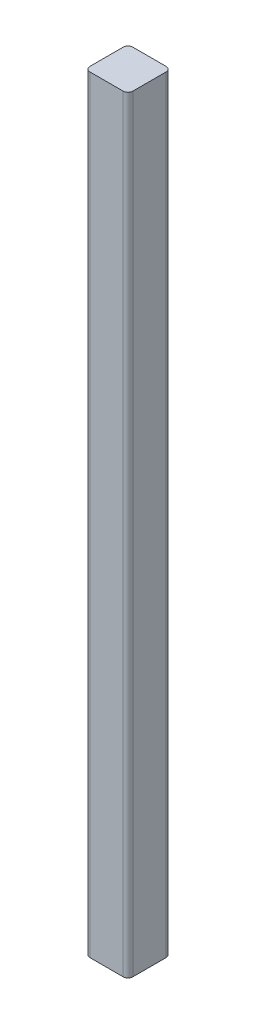
ISO-10303-21;
HEADER;
FILE_DESCRIPTION(('STEP AP214'),'2;1');
FILE_NAME('part.step','',(''),(''),'','','');
FILE_SCHEMA(('AUTOMOTIVE_DESIGN { 1 0 10303 214 1 1 1 1 }'));
ENDSEC;
DATA;
#1=APPLICATION_CONTEXT('core data for automotive mechanical design processes');
#2=APPLICATION_PROTOCOL_DEFINITION('international standard','automotive_design',2000,#1);
#3=PRODUCT_CONTEXT('',#1,'mechanical');
#4=PRODUCT('Part','Part','',(#3));
#5=PRODUCT_RELATED_PRODUCT_CATEGORY('part','',(#4));
#6=PRODUCT_DEFINITION_FORMATION('','',#4);
#7=PRODUCT_DEFINITION_CONTEXT('part definition',#1,'design');
#8=PRODUCT_DEFINITION('design','',#6,#7);
#9=PRODUCT_DEFINITION_SHAPE('','',#8);
#10=(LENGTH_UNIT() NAMED_UNIT(*) SI_UNIT(.MILLI.,.METRE.));
#11=(NAMED_UNIT(*) PLANE_ANGLE_UNIT() SI_UNIT($,.RADIAN.));
#12=(NAMED_UNIT(*) SI_UNIT($,.STERADIAN.) SOLID_ANGLE_UNIT());
#13=UNCERTAINTY_MEASURE_WITH_UNIT(LENGTH_MEASURE(1.E-05),#10,'distance_accuracy_value','');
#14=(GEOMETRIC_REPRESENTATION_CONTEXT(3) GLOBAL_UNCERTAINTY_ASSIGNED_CONTEXT((#13)) GLOBAL_UNIT_ASSIGNED_CONTEXT((#10,
#11,#12)) REPRESENTATION_CONTEXT('',''));
#15=CARTESIAN_POINT('',(0.,0.,0.));
#16=DIRECTION('',(0.,0.,1.));
#17=DIRECTION('',(1.,0.,0.));
#18=AXIS2_PLACEMENT_3D('',#15,#16,#17);
#19=CARTESIAN_POINT('',(20.,715.,-20.));
#20=DIRECTION('',(-1.,0.,0.));
#21=DIRECTION('',(0.,0.,1.));
#22=AXIS2_PLACEMENT_3D('',#19,#20,#21);
#23=PLANE('',#22);
#24=DIRECTION('',(0.,0.,-1.));
#25=VECTOR('',#24,1.);
#26=CARTESIAN_POINT('',(20.,0.,-20.));
#27=LINE('',#26,#25);
#28=CARTESIAN_POINT('',(20.,0.,15.5));
#29=VERTEX_POINT('',#28);
#30=CARTESIAN_POINT('',(20.,0.,-15.5));
#31=VERTEX_POINT('',#30);
#32=EDGE_CURVE('E141',#29,#31,#27,.T.);
#33=ORIENTED_EDGE('',*,*,#32,.T.);
#34=DIRECTION('',(0.,-1.,0.));
#35=VECTOR('',#34,1.);
#36=CARTESIAN_POINT('',(20.,715.,-15.5));
#37=LINE('',#36,#35);
#38=CARTESIAN_POINT('',(20.,715.,-15.5));
#39=VERTEX_POINT('',#38);
#40=EDGE_CURVE('E11',#31,#39,#37,.F.);
#41=ORIENTED_EDGE('',*,*,#40,.T.);
#42=DIRECTION('',(0.,0.,-1.));
#43=VECTOR('',#42,1.);
#44=CARTESIAN_POINT('',(20.,715.,-20.));
#45=LINE('',#44,#43);
#46=CARTESIAN_POINT('',(20.,715.,15.5));
#47=VERTEX_POINT('',#46);
#48=EDGE_CURVE('E139',#47,#39,#45,.T.);
#49=ORIENTED_EDGE('',*,*,#48,.F.);
#50=DIRECTION('',(0.,-1.,0.));
#51=VECTOR('',#50,1.);
#52=CARTESIAN_POINT('',(20.,715.,15.5));
#53=LINE('',#52,#51);
#54=EDGE_CURVE('E48',#47,#29,#53,.T.);
#55=ORIENTED_EDGE('',*,*,#54,.T.);
#56=EDGE_LOOP('',(#33,#41,#49,#55));
#57=FACE_BOUND('',#56,.T.);
#58=ADVANCED_FACE('F39',(#57),#23,.F.);
#59=CARTESIAN_POINT('',(-20.,715.,-20.));
#60=DIRECTION('',(0.,0.,1.));
#61=DIRECTION('',(1.,0.,0.));
#62=AXIS2_PLACEMENT_3D('',#59,#60,#61);
#63=PLANE('',#62);
#64=DIRECTION('',(-1.,0.,0.));
#65=VECTOR('',#64,1.);
#66=CARTESIAN_POINT('',(-20.,0.,-20.));
#67=LINE('',#66,#65);
#68=CARTESIAN_POINT('',(15.5,0.,-20.));
#69=VERTEX_POINT('',#68);
#70=CARTESIAN_POINT('',(-15.5,0.,-20.));
#71=VERTEX_POINT('',#70);
#72=EDGE_CURVE('E135',#69,#71,#67,.T.);
#73=ORIENTED_EDGE('',*,*,#72,.T.);
#74=DIRECTION('',(0.,-1.,0.));
#75=VECTOR('',#74,1.);
#76=CARTESIAN_POINT('',(-15.5,715.,-20.));
#77=LINE('',#76,#75);
#78=CARTESIAN_POINT('',(-15.5,715.,-20.));
#79=VERTEX_POINT('',#78);
#80=EDGE_CURVE('E111',#71,#79,#77,.F.);
#81=ORIENTED_EDGE('',*,*,#80,.T.);
#82=DIRECTION('',(-1.,0.,0.));
#83=VECTOR('',#82,1.);
#84=CARTESIAN_POINT('',(-20.,715.,-20.));
#85=LINE('',#84,#83);
#86=CARTESIAN_POINT('',(15.5,715.,-20.));
#87=VERTEX_POINT('',#86);
#88=EDGE_CURVE('E193',#87,#79,#85,.T.);
#89=ORIENTED_EDGE('',*,*,#88,.F.);
#90=DIRECTION('',(0.,-1.,0.));
#91=VECTOR('',#90,1.);
#92=CARTESIAN_POINT('',(15.5,715.,-20.));
#93=LINE('',#92,#91);
#94=EDGE_CURVE('E117',#87,#69,#93,.T.);
#95=ORIENTED_EDGE('',*,*,#94,.T.);
#96=EDGE_LOOP('',(#73,#81,#89,#95));
#97=FACE_BOUND('',#96,.T.);
#98=ADVANCED_FACE('F205',(#97),#63,.F.);
#99=CARTESIAN_POINT('',(-20.,715.,-20.));
#100=DIRECTION('',(1.,0.,0.));
#101=DIRECTION('',(0.,0.,-1.));
#102=AXIS2_PLACEMENT_3D('',#99,#100,#101);
#103=PLANE('',#102);
#104=DIRECTION('',(0.,0.,1.));
#105=VECTOR('',#104,1.);
#106=CARTESIAN_POINT('',(-20.,715.,-20.));
#107=LINE('',#106,#105);
#108=CARTESIAN_POINT('',(-20.,715.,-15.5));
#109=VERTEX_POINT('',#108);
#110=CARTESIAN_POINT('',(-20.,715.,15.5));
#111=VERTEX_POINT('',#110);
#112=EDGE_CURVE('E126',#109,#111,#107,.T.);
#113=ORIENTED_EDGE('',*,*,#112,.F.);
#114=DIRECTION('',(0.,-1.,0.));
#115=VECTOR('',#114,1.);
#116=CARTESIAN_POINT('',(-20.,715.,-15.5));
#117=LINE('',#116,#115);
#118=CARTESIAN_POINT('',(-20.,0.,-15.5));
#119=VERTEX_POINT('',#118);
#120=EDGE_CURVE('E110',#109,#119,#117,.T.);
#121=ORIENTED_EDGE('',*,*,#120,.T.);
#122=DIRECTION('',(0.,0.,1.));
#123=VECTOR('',#122,1.);
#124=CARTESIAN_POINT('',(-20.,0.,-20.));
#125=LINE('',#124,#123);
#126=CARTESIAN_POINT('',(-20.,0.,15.5));
#127=VERTEX_POINT('',#126);
#128=EDGE_CURVE('E124',#119,#127,#125,.T.);
#129=ORIENTED_EDGE('',*,*,#128,.T.);
#130=DIRECTION('',(0.,-1.,0.));
#131=VECTOR('',#130,1.);
#132=CARTESIAN_POINT('',(-20.,715.,15.5));
#133=LINE('',#132,#131);
#134=EDGE_CURVE('E129',#127,#111,#133,.F.);
#135=ORIENTED_EDGE('',*,*,#134,.T.);
#136=EDGE_LOOP('',(#113,#121,#129,#135));
#137=FACE_BOUND('',#136,.T.);
#138=ADVANCED_FACE('F123',(#137),#103,.F.);
#139=CARTESIAN_POINT('',(-20.,715.,20.));
#140=DIRECTION('',(0.,0.,-1.));
#141=DIRECTION('',(-1.,0.,0.));
#142=AXIS2_PLACEMENT_3D('',#139,#140,#141);
#143=PLANE('',#142);
#144=DIRECTION('',(1.,0.,0.));
#145=VECTOR('',#144,1.);
#146=CARTESIAN_POINT('',(-20.,715.,20.));
#147=LINE('',#146,#145);
#148=CARTESIAN_POINT('',(-15.5,715.,20.));
#149=VERTEX_POINT('',#148);
#150=CARTESIAN_POINT('',(15.5,715.,20.));
#151=VERTEX_POINT('',#150);
#152=EDGE_CURVE('E146',#149,#151,#147,.T.);
#153=ORIENTED_EDGE('',*,*,#152,.F.);
#154=DIRECTION('',(0.,-1.,0.));
#155=VECTOR('',#154,1.);
#156=CARTESIAN_POINT('',(-15.5,715.,20.));
#157=LINE('',#156,#155);
#158=CARTESIAN_POINT('',(-15.5,0.,20.));
#159=VERTEX_POINT('',#158);
#160=EDGE_CURVE('E173',#149,#159,#157,.T.);
#161=ORIENTED_EDGE('',*,*,#160,.T.);
#162=DIRECTION('',(1.,0.,0.));
#163=VECTOR('',#162,1.);
#164=CARTESIAN_POINT('',(-20.,0.,20.));
#165=LINE('',#164,#163);
#166=CARTESIAN_POINT('',(15.5,0.,20.));
#167=VERTEX_POINT('',#166);
#168=EDGE_CURVE('E134',#159,#167,#165,.T.);
#169=ORIENTED_EDGE('',*,*,#168,.T.);
#170=DIRECTION('',(0.,-1.,0.));
#171=VECTOR('',#170,1.);
#172=CARTESIAN_POINT('',(15.5,715.,20.));
#173=LINE('',#172,#171);
#174=EDGE_CURVE('E55',#167,#151,#173,.F.);
#175=ORIENTED_EDGE('',*,*,#174,.T.);
#176=EDGE_LOOP('',(#153,#161,#169,#175));
#177=FACE_BOUND('',#176,.T.);
#178=ADVANCED_FACE('F209',(#177),#143,.F.);
#179=CARTESIAN_POINT('',(0.,715.,0.));
#180=DIRECTION('',(0.,1.,0.));
#181=DIRECTION('',(0.,0.,1.));
#182=AXIS2_PLACEMENT_3D('',#179,#180,#181);
#183=PLANE('',#182);
#184=ORIENTED_EDGE('',*,*,#88,.T.);
#185=CARTESIAN_POINT('',(-15.5,715.,-15.5));
#186=DIRECTION('',(0.,1.,0.));
#187=DIRECTION('',(0.,0.,1.));
#188=AXIS2_PLACEMENT_3D('',#185,#186,#187);
#189=CIRCLE('',#188,4.5);
#190=EDGE_CURVE('E168',#79,#109,#189,.T.);
#191=ORIENTED_EDGE('',*,*,#190,.T.);
#192=ORIENTED_EDGE('',*,*,#112,.T.);
#193=CARTESIAN_POINT('',(-15.5,715.,15.5));
#194=DIRECTION('',(0.,1.,0.));
#195=DIRECTION('',(0.,0.,1.));
#196=AXIS2_PLACEMENT_3D('',#193,#194,#195);
#197=CIRCLE('',#196,4.5);
#198=EDGE_CURVE('E62',#111,#149,#197,.T.);
#199=ORIENTED_EDGE('',*,*,#198,.T.);
#200=ORIENTED_EDGE('',*,*,#152,.T.);
#201=CARTESIAN_POINT('',(15.5,715.,15.5));
#202=DIRECTION('',(0.,1.,0.));
#203=DIRECTION('',(0.,0.,1.));
#204=AXIS2_PLACEMENT_3D('',#201,#202,#203);
#205=CIRCLE('',#204,4.5);
#206=EDGE_CURVE('E160',#151,#47,#205,.T.);
#207=ORIENTED_EDGE('',*,*,#206,.T.);
#208=ORIENTED_EDGE('',*,*,#48,.T.);
#209=CARTESIAN_POINT('',(15.5,715.,-15.5));
#210=DIRECTION('',(0.,1.,0.));
#211=DIRECTION('',(0.,0.,1.));
#212=AXIS2_PLACEMENT_3D('',#209,#210,#211);
#213=CIRCLE('',#212,4.5);
#214=EDGE_CURVE('E163',#39,#87,#213,.T.);
#215=ORIENTED_EDGE('',*,*,#214,.T.);
#216=EDGE_LOOP('',(#184,#191,#192,#199,#200,#207,#208,#215));
#217=FACE_BOUND('',#216,.T.);
#218=ADVANCED_FACE('F199',(#217),#183,.T.);
#219=CARTESIAN_POINT('',(0.,0.,0.));
#220=DIRECTION('',(0.,1.,0.));
#221=DIRECTION('',(0.,0.,1.));
#222=AXIS2_PLACEMENT_3D('',#219,#220,#221);
#223=PLANE('',#222);
#224=ORIENTED_EDGE('',*,*,#128,.F.);
#225=CARTESIAN_POINT('',(-15.5,0.,-15.5));
#226=DIRECTION('',(0.,1.,0.));
#227=DIRECTION('',(0.,0.,1.));
#228=AXIS2_PLACEMENT_3D('',#225,#226,#227);
#229=CIRCLE('',#228,4.5);
#230=EDGE_CURVE('E106',#119,#71,#229,.F.);
#231=ORIENTED_EDGE('',*,*,#230,.T.);
#232=ORIENTED_EDGE('',*,*,#72,.F.);
#233=CARTESIAN_POINT('',(15.5,0.,-15.5));
#234=DIRECTION('',(0.,1.,0.));
#235=DIRECTION('',(0.,0.,1.));
#236=AXIS2_PLACEMENT_3D('',#233,#234,#235);
#237=CIRCLE('',#236,4.5);
#238=EDGE_CURVE('E150',#69,#31,#237,.F.);
#239=ORIENTED_EDGE('',*,*,#238,.T.);
#240=ORIENTED_EDGE('',*,*,#32,.F.);
#241=CARTESIAN_POINT('',(15.5,0.,15.5));
#242=DIRECTION('',(0.,1.,0.));
#243=DIRECTION('',(0.,0.,1.));
#244=AXIS2_PLACEMENT_3D('',#241,#242,#243);
#245=CIRCLE('',#244,4.5);
#246=EDGE_CURVE('E128',#29,#167,#245,.F.);
#247=ORIENTED_EDGE('',*,*,#246,.T.);
#248=ORIENTED_EDGE('',*,*,#168,.F.);
#249=CARTESIAN_POINT('',(-15.5,0.,15.5));
#250=DIRECTION('',(0.,1.,0.));
#251=DIRECTION('',(0.,0.,1.));
#252=AXIS2_PLACEMENT_3D('',#249,#250,#251);
#253=CIRCLE('',#252,4.5);
#254=EDGE_CURVE('E118',#159,#127,#253,.F.);
#255=ORIENTED_EDGE('',*,*,#254,.T.);
#256=EDGE_LOOP('',(#224,#231,#232,#239,#240,#247,#248,#255));
#257=FACE_BOUND('',#256,.T.);
#258=ADVANCED_FACE('F131',(#257),#223,.F.);
#259=CARTESIAN_POINT('',(-15.5,715.,-15.5));
#260=DIRECTION('',(0.,-1.,0.));
#261=DIRECTION('',(0.,0.,-1.));
#262=AXIS2_PLACEMENT_3D('',#259,#260,#261);
#263=CYLINDRICAL_SURFACE('',#262,4.5);
#264=ORIENTED_EDGE('',*,*,#190,.F.);
#265=ORIENTED_EDGE('',*,*,#80,.F.);
#266=ORIENTED_EDGE('',*,*,#230,.F.);
#267=ORIENTED_EDGE('',*,*,#120,.F.);
#268=EDGE_LOOP('',(#264,#265,#266,#267));
#269=FACE_BOUND('',#268,.T.);
#270=ADVANCED_FACE('F109',(#269),#263,.T.);
#271=CARTESIAN_POINT('',(-15.5,715.,15.5));
#272=DIRECTION('',(0.,-1.,0.));
#273=DIRECTION('',(0.,0.,-1.));
#274=AXIS2_PLACEMENT_3D('',#271,#272,#273);
#275=CYLINDRICAL_SURFACE('',#274,4.5);
#276=ORIENTED_EDGE('',*,*,#198,.F.);
#277=ORIENTED_EDGE('',*,*,#134,.F.);
#278=ORIENTED_EDGE('',*,*,#254,.F.);
#279=ORIENTED_EDGE('',*,*,#160,.F.);
#280=EDGE_LOOP('',(#276,#277,#278,#279));
#281=FACE_BOUND('',#280,.T.);
#282=ADVANCED_FACE('F208',(#281),#275,.T.);
#283=CARTESIAN_POINT('',(15.5,715.,-15.5));
#284=DIRECTION('',(0.,-1.,0.));
#285=DIRECTION('',(0.,0.,-1.));
#286=AXIS2_PLACEMENT_3D('',#283,#284,#285);
#287=CYLINDRICAL_SURFACE('',#286,4.5);
#288=ORIENTED_EDGE('',*,*,#214,.F.);
#289=ORIENTED_EDGE('',*,*,#40,.F.);
#290=ORIENTED_EDGE('',*,*,#238,.F.);
#291=ORIENTED_EDGE('',*,*,#94,.F.);
#292=EDGE_LOOP('',(#288,#289,#290,#291));
#293=FACE_BOUND('',#292,.T.);
#294=ADVANCED_FACE('F203',(#293),#287,.T.);
#295=CARTESIAN_POINT('',(15.5,715.,15.5));
#296=DIRECTION('',(0.,-1.,0.));
#297=DIRECTION('',(0.,0.,-1.));
#298=AXIS2_PLACEMENT_3D('',#295,#296,#297);
#299=CYLINDRICAL_SURFACE('',#298,4.5);
#300=ORIENTED_EDGE('',*,*,#206,.F.);
#301=ORIENTED_EDGE('',*,*,#174,.F.);
#302=ORIENTED_EDGE('',*,*,#246,.F.);
#303=ORIENTED_EDGE('',*,*,#54,.F.);
#304=EDGE_LOOP('',(#300,#301,#302,#303));
#305=FACE_BOUND('',#304,.T.);
#306=ADVANCED_FACE('F41',(#305),#299,.T.);
#307=CLOSED_SHELL('',(#58,#98,#138,#178,#218,#258,#270,#282,#294,#306));
#308=MANIFOLD_SOLID_BREP('B2',#307);
#309=ADVANCED_BREP_SHAPE_REPRESENTATION('',(#18,#308),#14);
#310=SHAPE_DEFINITION_REPRESENTATION(#9,#309);
ENDSEC;
END-ISO-10303-21;
